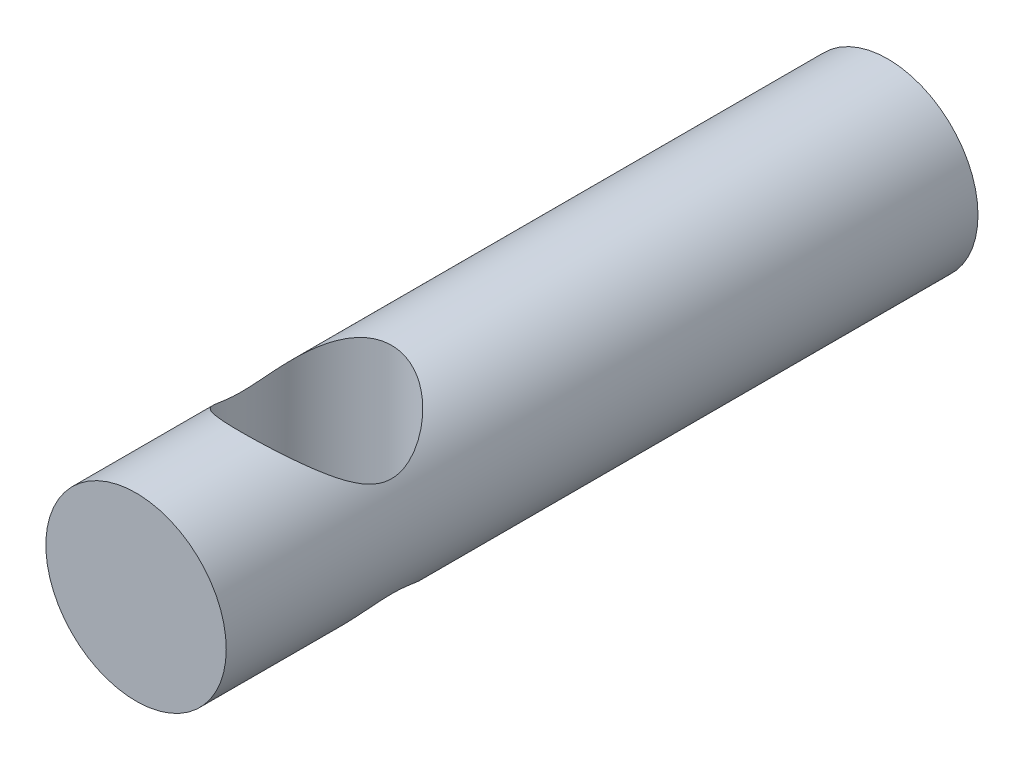
ISO-10303-21;
HEADER;
FILE_DESCRIPTION(('STEP AP214'),'2;1');
FILE_NAME('part.step','',(''),(''),'','','');
FILE_SCHEMA(('AUTOMOTIVE_DESIGN { 1 0 10303 214 1 1 1 1 }'));
ENDSEC;
DATA;
#1=APPLICATION_CONTEXT('core data for automotive mechanical design processes');
#2=APPLICATION_PROTOCOL_DEFINITION('international standard','automotive_design',2000,#1);
#3=PRODUCT_CONTEXT('',#1,'mechanical');
#4=PRODUCT('Part','Part','',(#3));
#5=PRODUCT_RELATED_PRODUCT_CATEGORY('part','',(#4));
#6=PRODUCT_DEFINITION_FORMATION('','',#4);
#7=PRODUCT_DEFINITION_CONTEXT('part definition',#1,'design');
#8=PRODUCT_DEFINITION('design','',#6,#7);
#9=PRODUCT_DEFINITION_SHAPE('','',#8);
#10=(LENGTH_UNIT() NAMED_UNIT(*) SI_UNIT(.MILLI.,.METRE.));
#11=(NAMED_UNIT(*) PLANE_ANGLE_UNIT() SI_UNIT($,.RADIAN.));
#12=(NAMED_UNIT(*) SI_UNIT($,.STERADIAN.) SOLID_ANGLE_UNIT());
#13=UNCERTAINTY_MEASURE_WITH_UNIT(LENGTH_MEASURE(1.E-05),#10,'distance_accuracy_value','');
#14=(GEOMETRIC_REPRESENTATION_CONTEXT(3) GLOBAL_UNCERTAINTY_ASSIGNED_CONTEXT((#13)) GLOBAL_UNIT_ASSIGNED_CONTEXT((#10,
#11,#12)) REPRESENTATION_CONTEXT('',''));
#15=CARTESIAN_POINT('',(0.,0.,0.));
#16=DIRECTION('',(0.,0.,1.));
#17=DIRECTION('',(1.,0.,0.));
#18=AXIS2_PLACEMENT_3D('',#15,#16,#17);
#19=CARTESIAN_POINT('',(0.,0.,50.));
#20=DIRECTION('',(0.,0.,-1.));
#21=DIRECTION('',(-1.,0.,0.));
#22=AXIS2_PLACEMENT_3D('',#19,#20,#21);
#23=CYLINDRICAL_SURFACE('',#22,6.);
#24=CARTESIAN_POINT('',(0.,-6.,43.));
#25=CARTESIAN_POINT('',(0.118803401095405,-6.00000636279643,43.0000064862677));
#26=CARTESIAN_POINT('',(0.237558182871218,-5.9964675633917,42.9957624327627));
#27=CARTESIAN_POINT('',(0.474087838067091,-5.98241218121961,42.978883422429));
#28=CARTESIAN_POINT('',(0.591862597565708,-5.97189479839916,42.9662475035226));
#29=CARTESIAN_POINT('',(0.825474733693953,-5.94410935213455,42.9328006783858));
#30=CARTESIAN_POINT('',(0.941311384241483,-5.92683881527392,42.9119867768663));
#31=CARTESIAN_POINT('',(1.17018155731566,-5.88593383048318,42.8625514514852));
#32=CARTESIAN_POINT('',(1.28321381003106,-5.86229655516696,42.8339265587894));
#33=CARTESIAN_POINT('',(1.61550772291657,-5.78287450226039,42.7374036224078));
#34=CARTESIAN_POINT('',(1.82964493287683,-5.71836951829061,42.6586078935356));
#35=CARTESIAN_POINT('',(2.23973970904935,-5.57056793109677,42.4759478557694));
#36=CARTESIAN_POINT('',(2.43569110189251,-5.48726497939233,42.3720750769835));
#37=CARTESIAN_POINT('',(2.74874935510359,-5.33520303254702,42.1793176524655));
#38=CARTESIAN_POINT('',(2.87121824175386,-5.27015451867263,42.0960532176638));
#39=CARTESIAN_POINT('',(3.10654667374618,-5.13495608214751,41.9205749148789));
#40=CARTESIAN_POINT('',(3.21940634431806,-5.06480622600091,41.8283611635591));
#41=CARTESIAN_POINT('',(3.43568816068562,-4.92066908923446,41.6355330827868));
#42=CARTESIAN_POINT('',(3.53908406033977,-4.84667197890407,41.5348967895774));
#43=CARTESIAN_POINT('',(3.73607907111508,-4.69649318853079,41.3260070437939));
#44=CARTESIAN_POINT('',(3.82967941338621,-4.62031178455679,41.2177545513249));
#45=CARTESIAN_POINT('',(4.00872533168448,-4.46590940619064,40.9918684752431));
#46=CARTESIAN_POINT('',(4.09398918746846,-4.38767669457347,40.874098937329));
#47=CARTESIAN_POINT('',(4.25431125048952,-4.23240914046917,40.630978700986));
#48=CARTESIAN_POINT('',(4.32936604026974,-4.15537470670733,40.5056254841293));
#49=CARTESIAN_POINT('',(4.46882104937819,-4.00501156130571,40.2474686695054));
#50=CARTESIAN_POINT('',(4.53324636625594,-3.93167441297209,40.1146836425388));
#51=CARTESIAN_POINT('',(4.65107409789266,-3.79155403229088,39.8411042236429));
#52=CARTESIAN_POINT('',(4.70448590476211,-3.72476524134073,39.7003167878289));
#53=CARTESIAN_POINT('',(4.8038705578035,-3.59583630496641,39.3966762287444));
#54=CARTESIAN_POINT('',(4.8486776643058,-3.53471789619366,39.2329915636929));
#55=CARTESIAN_POINT('',(4.92202476595886,-3.43187191424553,38.8961808118177));
#56=CARTESIAN_POINT('',(4.95060424437364,-3.39009732197608,38.7230787737634));
#57=CARTESIAN_POINT('',(4.97982440219376,-3.34688431376343,38.4576618963693));
#58=CARTESIAN_POINT('',(4.98729261982802,-3.33571370000032,38.3676186790102));
#59=CARTESIAN_POINT('',(4.99733565959028,-3.3206515347262,38.186635888056));
#60=CARTESIAN_POINT('',(4.99991093928053,-3.31675930257913,38.0956963990751));
#61=CARTESIAN_POINT('',(5.00008454722765,-3.31649708247112,37.9138046447105));
#62=CARTESIAN_POINT('',(4.99768286475912,-3.32012711072077,37.8228523792997));
#63=CARTESIAN_POINT('',(4.98797701095387,-3.33469045716225,37.6418002126219));
#64=CARTESIAN_POINT('',(4.9806722424497,-3.34562466496004,37.5517004165364));
#65=CARTESIAN_POINT('',(4.9605577711742,-3.37538324774709,37.3657096540125));
#66=CARTESIAN_POINT('',(4.94734291419499,-3.3947851529219,37.2699556702802));
#67=CARTESIAN_POINT('',(4.9157405398429,-3.44038747060614,37.0809279610888));
#68=CARTESIAN_POINT('',(4.89734936269663,-3.46659269219059,36.9876560417588));
#69=CARTESIAN_POINT('',(4.83487145070514,-3.55374344299518,36.7117320482717));
#70=CARTESIAN_POINT('',(4.78352415648848,-3.62315426397916,36.5333547362934));
#71=CARTESIAN_POINT('',(4.67632227850057,-3.76004871810486,36.2243192312532));
#72=CARTESIAN_POINT('',(4.62355194613134,-3.82500795712382,36.0913773000058));
#73=CARTESIAN_POINT('',(4.50808681272013,-3.96043831206372,35.8326966005586));
#74=CARTESIAN_POINT('',(4.44538619181528,-4.03091264789804,35.7069621156634));
#75=CARTESIAN_POINT('',(4.31043075762212,-4.17491879023624,35.4623371484108));
#76=CARTESIAN_POINT('',(4.23816312441515,-4.24845460689311,35.3434561621898));
#77=CARTESIAN_POINT('',(4.0843540141714,-4.39652708661221,35.112564357148));
#78=CARTESIAN_POINT('',(4.00281439970954,-4.47106354601933,35.0005521654441));
#79=CARTESIAN_POINT('',(3.82600354374307,-4.62342077684068,34.7777389037107));
#80=CARTESIAN_POINT('',(3.73023700414125,-4.70120929265264,34.6673079801861));
#81=CARTESIAN_POINT('',(3.52848927170201,-4.85446404087317,34.4544006001851));
#82=CARTESIAN_POINT('',(3.42250656330085,-4.92992992652313,34.3519253280094));
#83=CARTESIAN_POINT('',(3.20056123189974,-5.07681645366273,34.1557470520335));
#84=CARTESIAN_POINT('',(3.08461970676718,-5.14824514018381,34.0620263404979));
#85=CARTESIAN_POINT('',(2.84274064052497,-5.28566109460445,33.8840057357877));
#86=CARTESIAN_POINT('',(2.71680273442448,-5.35164816363854,33.7997061868722));
#87=CARTESIAN_POINT('',(2.38827463214804,-5.50853314592501,33.6012144581578));
#88=CARTESIAN_POINT('',(2.17932731194454,-5.59498946786027,33.4936807046978));
#89=CARTESIAN_POINT('',(1.85137170360811,-5.70840387054069,33.3538617808569));
#90=CARTESIAN_POINT('',(1.73959798407547,-5.74350440601256,33.3108268778131));
#91=CARTESIAN_POINT('',(1.51170856686386,-5.80764297166477,33.2324820657828));
#92=CARTESIAN_POINT('',(1.39559507719869,-5.83668403661188,33.1971682893954));
#93=CARTESIAN_POINT('',(1.15874024023433,-5.88830518104936,33.1345654668072));
#94=CARTESIAN_POINT('',(1.03796855116845,-5.91082981449132,33.107345234438));
#95=CARTESIAN_POINT('',(0.793680719841957,-5.94855722519953,33.0618327777203));
#96=CARTESIAN_POINT('',(0.670165967971726,-5.96376362711192,33.0435361335484));
#97=CARTESIAN_POINT('',(0.421443909131288,-5.98648272603519,33.0162230296845));
#98=CARTESIAN_POINT('',(0.296237084023924,-5.99399756851713,33.0072039821113));
#99=CARTESIAN_POINT('',(0.045281360658765,-6.00114166173048,32.9986294616952));
#100=CARTESIAN_POINT('',(-0.0804674771283793,-6.00077177047715,32.9990729591399));
#101=CARTESIAN_POINT('',(-0.316217699577978,-5.99267919208227,33.0087868090915));
#102=CARTESIAN_POINT('',(-0.426296149457811,-5.98584511760915,33.0169904113187));
#103=CARTESIAN_POINT('',(-0.645178571447246,-5.96622340308935,33.0405781997558));
#104=CARTESIAN_POINT('',(-0.753982136950641,-5.95343391393135,33.055964616179));
#105=CARTESIAN_POINT('',(-0.969508932578334,-5.922153588973,33.0936760737209));
#106=CARTESIAN_POINT('',(-1.07623280976895,-5.90366455762228,33.1159989188149));
#107=CARTESIAN_POINT('',(-1.28701083316511,-5.86132925877315,33.1672588546036));
#108=CARTESIAN_POINT('',(-1.39106394571242,-5.83748095091222,33.1961984644799));
#109=CARTESIAN_POINT('',(-1.70100357204863,-5.7578099796654,33.293220918707));
#110=CARTESIAN_POINT('',(-1.90197317990272,-5.69426548906173,33.3710253648875));
#111=CARTESIAN_POINT('',(-2.28736622034061,-5.55070829820293,33.5488074846758));
#112=CARTESIAN_POINT('',(-2.4717835011244,-5.47068951124314,33.6487933546439));
#113=CARTESIAN_POINT('',(-2.77431022087586,-5.32196402989805,33.8375869663724));
#114=CARTESIAN_POINT('',(-2.89671891082122,-5.25618753965957,33.9219211863686));
#115=CARTESIAN_POINT('',(-3.131821244568,-5.11958730343164,34.099563688916));
#116=CARTESIAN_POINT('',(-3.24451452031804,-5.04876336641404,34.1928723111637));
#117=CARTESIAN_POINT('',(-3.46039828484841,-4.9033290991082,34.3879535768143));
#118=CARTESIAN_POINT('',(-3.56355916557859,-4.82870801884465,34.4897508388439));
#119=CARTESIAN_POINT('',(-3.75997885952874,-4.67738428016309,34.7010061199085));
#120=CARTESIAN_POINT('',(-3.85323906840846,-4.60068191705468,34.8104630555697));
#121=CARTESIAN_POINT('',(-4.03144708201687,-4.44540721169773,35.0387864958512));
#122=CARTESIAN_POINT('',(-4.11621624228698,-4.36682597084091,35.1577863469535));
#123=CARTESIAN_POINT('',(-4.27543853436326,-4.21106013919064,35.4034518346895));
#124=CARTESIAN_POINT('',(-4.34988795406828,-4.13387605960318,35.5301202063392));
#125=CARTESIAN_POINT('',(-4.48797579821676,-3.98352281099524,35.7909734658198));
#126=CARTESIAN_POINT('',(-4.55164272839412,-3.9103434132128,35.9251372468657));
#127=CARTESIAN_POINT('',(-4.66777738062598,-3.77095158572992,36.2015834075756));
#128=CARTESIAN_POINT('',(-4.72025536508448,-3.70473280033071,36.3438581947439));
#129=CARTESIAN_POINT('',(-4.81674752553354,-3.57850891369614,36.6485305374172));
#130=CARTESIAN_POINT('',(-4.85976816309609,-3.51940536010279,36.8116302195377));
#131=CARTESIAN_POINT('',(-4.92964324178357,-3.42087013106355,37.1469424932384));
#132=CARTESIAN_POINT('',(-4.95653805629938,-3.38138936984465,37.31913114198));
#133=CARTESIAN_POINT('',(-4.98335884043903,-3.34161185607347,37.5827328811766));
#134=CARTESIAN_POINT('',(-4.9900439743412,-3.33159299706688,37.6720601142706));
#135=CARTESIAN_POINT('',(-4.99859875462369,-3.31874657694375,37.851477467416));
#136=CARTESIAN_POINT('',(-5.00046880529626,-3.31591841207014,37.9415675227807));
#137=CARTESIAN_POINT('',(-4.99933140644564,-3.31763235091844,38.1216442281894));
#138=CARTESIAN_POINT('',(-4.99632384110741,-3.32217462964556,38.2116308757273));
#139=CARTESIAN_POINT('',(-4.98551920595954,-3.33836659549378,38.3907057316909));
#140=CARTESIAN_POINT('',(-4.97771962684742,-3.3500200062847,38.4797934445376));
#141=CARTESIAN_POINT('',(-4.95646386284238,-3.38139896959306,38.6656700002972));
#142=CARTESIAN_POINT('',(-4.94249693749092,-3.40184751901395,38.7622775823279));
#143=CARTESIAN_POINT('',(-4.90931375512976,-3.44956299936088,38.9528976553845));
#144=CARTESIAN_POINT('',(-4.89009367595845,-3.47683489368277,39.0469082017716));
#145=CARTESIAN_POINT('',(-4.82502893529809,-3.56715037769761,39.324905192478));
#146=CARTESIAN_POINT('',(-4.7718260132866,-3.63862034946249,39.5044742591731));
#147=CARTESIAN_POINT('',(-4.66101333620415,-3.77905708413606,39.8156053015322));
#148=CARTESIAN_POINT('',(-4.60651894445035,-3.84555788327451,39.9494855746156));
#149=CARTESIAN_POINT('',(-4.48741065580202,-3.98390215298826,40.2098947178368));
#150=CARTESIAN_POINT('',(-4.42279087534717,-4.05574871700041,40.3364192548024));
#151=CARTESIAN_POINT('',(-4.28378589016391,-4.20230923095865,40.5824750393764));
#152=CARTESIAN_POINT('',(-4.20938767793868,-4.27702690475066,40.7019966598466));
#153=CARTESIAN_POINT('',(-4.05109347216151,-4.42725084654703,40.9339993633005));
#154=CARTESIAN_POINT('',(-3.96719939385689,-4.50275695275139,41.0464818589428));
#155=CARTESIAN_POINT('',(-3.78559728592263,-4.65661946215906,41.2697029917224));
#156=CARTESIAN_POINT('',(-3.68741297206343,-4.73493356113396,41.3800842070447));
#157=CARTESIAN_POINT('',(-3.48062708656676,-4.88895347699909,41.5926628641469));
#158=CARTESIAN_POINT('',(-3.37202387840544,-4.96465888158803,41.694859015636));
#159=CARTESIAN_POINT('',(-3.14465963115802,-5.11169145947054,41.8901812782145));
#160=CARTESIAN_POINT('',(-3.02592088507471,-5.18302767756748,41.9833263782086));
#161=CARTESIAN_POINT('',(-2.77827797167406,-5.31988980472136,42.1598471824308));
#162=CARTESIAN_POINT('',(-2.64937275881189,-5.38541511469399,42.2432218796487));
#163=CARTESIAN_POINT('',(-2.31715775505754,-5.538800757023,42.4365839258149));
#164=CARTESIAN_POINT('',(-2.10785901335215,-5.62226392609453,42.5401082380941));
#165=CARTESIAN_POINT('',(-1.78004652854701,-5.73103285742107,42.6739058337314));
#166=CARTESIAN_POINT('',(-1.66848545194815,-5.76454715656679,42.7149183204556));
#167=CARTESIAN_POINT('',(-1.44122911865488,-5.82552080229895,42.7892741907767));
#168=CARTESIAN_POINT('',(-1.32553443865744,-5.8529809897173,42.8226186393853));
#169=CARTESIAN_POINT('',(-1.01333234603961,-5.91714489125081,42.9003434639148));
#170=CARTESIAN_POINT('',(-0.813745597053237,-5.94804013902009,42.937546782437));
#171=CARTESIAN_POINT('',(-0.409390797411395,-5.98946116455115,42.987368198136));
#172=CARTESIAN_POINT('',(-0.204623282772278,-5.99998904091734,42.9999888282543));
#173=CARTESIAN_POINT('',(0.,-6.,43.));
#174=B_SPLINE_CURVE_WITH_KNOTS('',3,(#24,#25,#26,#27,#28,#29,#30,#31,#32,#33,#34,#35,#36,#37,
#38,#39,#40,#41,#42,#43,#44,#45,#46,#47,#48,#49,#50,#51,#52,#53,#54,#55,#56,#57,#58,#59,#60,#61,
#62,#63,#64,#65,#66,#67,#68,#69,#70,#71,#72,#73,#74,#75,#76,#77,#78,#79,#80,#81,#82,#83,#84,#85,
#86,#87,#88,#89,#90,#91,#92,#93,#94,#95,#96,#97,#98,#99,#100,#101,#102,#103,#104,#105,#106,#107,
#108,#109,#110,#111,#112,#113,#114,#115,#116,#117,#118,#119,#120,#121,#122,#123,#124,#125,#126,
#127,#128,#129,#130,#131,#132,#133,#134,#135,#136,#137,#138,#139,#140,#141,#142,#143,#144,#145,
#146,#147,#148,#149,#150,#151,#152,#153,#154,#155,#156,#157,#158,#159,#160,#161,#162,#163,#164,
#165,#166,#167,#168,#169,#170,#171,#172,#173),.UNSPECIFIED.,.T.,.F.,(4,2,2,2,2,2,2,2,2,2,2,2,2,
2,2,2,2,2,2,2,2,2,2,2,2,2,2,2,2,2,2,2,2,2,2,2,2,2,2,2,2,2,2,2,2,2,2,2,2,2,2,2,2,2,2,2,2,2,2,2,2,
2,2,2,2,2,2,2,2,2,2,2,2,2,4),(0.,0.356198531128419,0.712437905356866,1.06880787854775,
1.42533637270188,2.13333209783897,2.84156728725027,3.32622201622343,3.81087042808177,
4.2968245963956,4.78271761425373,5.2775503603996,5.77254834493271,6.26636031071475,
6.75974940543413,7.29936255278481,7.83765708456692,8.11040822806104,8.38313386402393,
8.65586008771504,8.92861953390792,9.22392701856221,9.51944381892724,10.1116379066242,
10.5823769120489,11.0533928323055,11.5250464324407,11.9966054526408,12.4928422896337,
12.9891528567514,13.4844367603639,13.9797387562551,14.7274446962693,15.10150349884,
15.4753745093337,15.8523389140401,16.2291164194432,16.6057887984766,16.9824201883012,
17.3138076935884,17.6452981608744,17.9766837873554,18.3081957920453,18.9794342536,
19.6509211619365,20.1379627282136,20.6250227371037,21.1135480143902,21.6020043344423,
22.0992028034934,22.5965796576366,23.0926203414622,23.5882040850607,24.1228614856737,
24.6561746412001,24.9262177314021,25.196238147046,25.4662649741992,25.7364333195518,
26.0351569724179,26.3340985560114,26.9331443359532,27.4099325615983,27.8869988690867,
28.3647063284082,28.8423176087131,29.3434029116174,29.8445670506109,30.3446559675372,
30.8447963820891,31.5852621624668,31.9553671316833,32.325420666041,32.9389891607904,
33.5524944315665),.UNSPECIFIED.);
#175=CARTESIAN_POINT('',(0.,-6.,43.));
#176=VERTEX_POINT('',#175);
#177=EDGE_CURVE('E10',#176,#176,#174,.T.);
#178=ORIENTED_EDGE('',*,*,#177,.T.);
#179=EDGE_LOOP('',(#178));
#180=FACE_BOUND('',#179,.T.);
#181=CARTESIAN_POINT('',(0.,6.,43.));
#182=CARTESIAN_POINT('',(-0.118803401095405,6.00000636279643,43.0000064862677));
#183=CARTESIAN_POINT('',(-0.237558182871218,5.9964675633917,42.9957624327627));
#184=CARTESIAN_POINT('',(-0.474087838067092,5.98241218121961,42.978883422429));
#185=CARTESIAN_POINT('',(-0.591862597565709,5.97189479839916,42.9662475035226));
#186=CARTESIAN_POINT('',(-0.825474733693953,5.94410935213455,42.9328006783858));
#187=CARTESIAN_POINT('',(-0.941311384241483,5.92683881527392,42.9119867768663));
#188=CARTESIAN_POINT('',(-1.17018155731566,5.88593383048317,42.8625514514852));
#189=CARTESIAN_POINT('',(-1.28321381003106,5.86229655516696,42.8339265587894));
#190=CARTESIAN_POINT('',(-1.61550772291657,5.78287450226039,42.7374036224078));
#191=CARTESIAN_POINT('',(-1.82964493287683,5.71836951829061,42.6586078935356));
#192=CARTESIAN_POINT('',(-2.23973970904936,5.57056793109677,42.4759478557694));
#193=CARTESIAN_POINT('',(-2.43569110189251,5.48726497939233,42.3720750769835));
#194=CARTESIAN_POINT('',(-2.74874935510359,5.33520303254702,42.1793176524655));
#195=CARTESIAN_POINT('',(-2.87121824175386,5.27015451867263,42.0960532176638));
#196=CARTESIAN_POINT('',(-3.10654667374618,5.13495608214751,41.9205749148789));
#197=CARTESIAN_POINT('',(-3.21940634431806,5.06480622600091,41.8283611635591));
#198=CARTESIAN_POINT('',(-3.43568816068562,4.92066908923446,41.6355330827867));
#199=CARTESIAN_POINT('',(-3.53908406033977,4.84667197890407,41.5348967895774));
#200=CARTESIAN_POINT('',(-3.73607907111508,4.69649318853078,41.3260070437939));
#201=CARTESIAN_POINT('',(-3.82967941338621,4.62031178455678,41.2177545513249));
#202=CARTESIAN_POINT('',(-4.00872533168449,4.46590940619063,40.9918684752431));
#203=CARTESIAN_POINT('',(-4.09398918746846,4.38767669457347,40.874098937329));
#204=CARTESIAN_POINT('',(-4.25431125048953,4.23240914046916,40.6309787009859));
#205=CARTESIAN_POINT('',(-4.32936604026975,4.15537470670733,40.5056254841293));
#206=CARTESIAN_POINT('',(-4.4688210493782,4.0050115613057,40.2474686695054));
#207=CARTESIAN_POINT('',(-4.53324636625595,3.93167441297208,40.1146836425388));
#208=CARTESIAN_POINT('',(-4.65107409789267,3.79155403229088,39.8411042236429));
#209=CARTESIAN_POINT('',(-4.70448590476211,3.72476524134072,39.7003167878289));
#210=CARTESIAN_POINT('',(-4.8038705578035,3.59583630496641,39.3966762287444));
#211=CARTESIAN_POINT('',(-4.8486776643058,3.53471789619366,39.2329915636929));
#212=CARTESIAN_POINT('',(-4.92202476595886,3.43187191424553,38.8961808118177));
#213=CARTESIAN_POINT('',(-4.95060424437364,3.39009732197608,38.7230787737634));
#214=CARTESIAN_POINT('',(-4.97982440219376,3.34688431376343,38.4576618963693));
#215=CARTESIAN_POINT('',(-4.98729261982801,3.33571370000033,38.3676186790102));
#216=CARTESIAN_POINT('',(-4.99733565959028,3.3206515347262,38.186635888056));
#217=CARTESIAN_POINT('',(-4.99991093928052,3.31675930257913,38.0956963990751));
#218=CARTESIAN_POINT('',(-5.00008454722765,3.31649708247112,37.9138046447105));
#219=CARTESIAN_POINT('',(-4.99768286475912,3.32012711072076,37.8228523792997));
#220=CARTESIAN_POINT('',(-4.98797701095387,3.33469045716225,37.6418002126219));
#221=CARTESIAN_POINT('',(-4.9806722424497,3.34562466496004,37.5517004165364));
#222=CARTESIAN_POINT('',(-4.9605577711742,3.37538324774709,37.3657096540125));
#223=CARTESIAN_POINT('',(-4.94734291419499,3.3947851529219,37.2699556702802));
#224=CARTESIAN_POINT('',(-4.9157405398429,3.44038747060614,37.0809279610888));
#225=CARTESIAN_POINT('',(-4.89734936269664,3.46659269219059,36.9876560417588));
#226=CARTESIAN_POINT('',(-4.83487145070514,3.55374344299518,36.7117320482717));
#227=CARTESIAN_POINT('',(-4.78352415648848,3.62315426397916,36.5333547362934));
#228=CARTESIAN_POINT('',(-4.67632227850057,3.76004871810486,36.2243192312532));
#229=CARTESIAN_POINT('',(-4.62355194613134,3.82500795712382,36.0913773000058));
#230=CARTESIAN_POINT('',(-4.50808681272013,3.96043831206372,35.8326966005586));
#231=CARTESIAN_POINT('',(-4.44538619181528,4.03091264789804,35.7069621156634));
#232=CARTESIAN_POINT('',(-4.31043075762212,4.17491879023624,35.4623371484108));
#233=CARTESIAN_POINT('',(-4.23816312441515,4.24845460689311,35.3434561621898));
#234=CARTESIAN_POINT('',(-4.08435401417139,4.39652708661221,35.112564357148));
#235=CARTESIAN_POINT('',(-4.00281439970954,4.47106354601933,35.0005521654441));
#236=CARTESIAN_POINT('',(-3.82600354374307,4.62342077684068,34.7777389037107));
#237=CARTESIAN_POINT('',(-3.73023700414125,4.70120929265264,34.6673079801861));
#238=CARTESIAN_POINT('',(-3.52848927170202,4.85446404087317,34.4544006001851));
#239=CARTESIAN_POINT('',(-3.42250656330085,4.92992992652313,34.3519253280094));
#240=CARTESIAN_POINT('',(-3.20056123189974,5.07681645366273,34.1557470520335));
#241=CARTESIAN_POINT('',(-3.08461970676718,5.14824514018381,34.0620263404979));
#242=CARTESIAN_POINT('',(-2.84274064052497,5.28566109460445,33.8840057357877));
#243=CARTESIAN_POINT('',(-2.71680273442449,5.35164816363853,33.7997061868722));
#244=CARTESIAN_POINT('',(-2.38827463214804,5.50853314592501,33.6012144581578));
#245=CARTESIAN_POINT('',(-2.17932731194454,5.59498946786026,33.4936807046978));
#246=CARTESIAN_POINT('',(-1.85137170360811,5.70840387054069,33.3538617808569));
#247=CARTESIAN_POINT('',(-1.73959798407548,5.74350440601255,33.3108268778131));
#248=CARTESIAN_POINT('',(-1.51170856686386,5.80764297166477,33.2324820657828));
#249=CARTESIAN_POINT('',(-1.3955950771987,5.83668403661188,33.1971682893954));
#250=CARTESIAN_POINT('',(-1.15874024023433,5.88830518104936,33.1345654668072));
#251=CARTESIAN_POINT('',(-1.03796855116845,5.91082981449132,33.107345234438));
#252=CARTESIAN_POINT('',(-0.793680719841959,5.94855722519953,33.0618327777203));
#253=CARTESIAN_POINT('',(-0.670165967971729,5.96376362711192,33.0435361335484));
#254=CARTESIAN_POINT('',(-0.421443909131291,5.98648272603519,33.0162230296845));
#255=CARTESIAN_POINT('',(-0.296237084023929,5.99399756851713,33.0072039821113));
#256=CARTESIAN_POINT('',(-0.0452813606587702,6.00114166173048,32.9986294616952));
#257=CARTESIAN_POINT('',(0.0804674771283748,6.00077177047715,32.9990729591399));
#258=CARTESIAN_POINT('',(0.316217699577974,5.99267919208227,33.0087868090915));
#259=CARTESIAN_POINT('',(0.426296149457807,5.98584511760915,33.0169904113187));
#260=CARTESIAN_POINT('',(0.645178571447243,5.96622340308935,33.0405781997558));
#261=CARTESIAN_POINT('',(0.753982136950637,5.95343391393135,33.055964616179));
#262=CARTESIAN_POINT('',(0.969508932578331,5.92215358897301,33.0936760737209));
#263=CARTESIAN_POINT('',(1.07623280976895,5.90366455762228,33.1159989188149));
#264=CARTESIAN_POINT('',(1.28701083316511,5.86132925877315,33.1672588546036));
#265=CARTESIAN_POINT('',(1.39106394571242,5.83748095091223,33.1961984644799));
#266=CARTESIAN_POINT('',(1.70100357204863,5.7578099796654,33.293220918707));
#267=CARTESIAN_POINT('',(1.90197317990272,5.69426548906173,33.3710253648875));
#268=CARTESIAN_POINT('',(2.28736622034061,5.55070829820293,33.5488074846758));
#269=CARTESIAN_POINT('',(2.4717835011244,5.47068951124314,33.6487933546439));
#270=CARTESIAN_POINT('',(2.77431022087586,5.32196402989805,33.8375869663724));
#271=CARTESIAN_POINT('',(2.89671891082122,5.25618753965957,33.9219211863686));
#272=CARTESIAN_POINT('',(3.131821244568,5.11958730343164,34.099563688916));
#273=CARTESIAN_POINT('',(3.24451452031804,5.04876336641404,34.1928723111637));
#274=CARTESIAN_POINT('',(3.46039828484841,4.9033290991082,34.3879535768143));
#275=CARTESIAN_POINT('',(3.56355916557859,4.82870801884465,34.4897508388439));
#276=CARTESIAN_POINT('',(3.75997885952874,4.67738428016309,34.7010061199085));
#277=CARTESIAN_POINT('',(3.85323906840846,4.60068191705468,34.8104630555697));
#278=CARTESIAN_POINT('',(4.03144708201687,4.44540721169773,35.0387864958512));
#279=CARTESIAN_POINT('',(4.11621624228698,4.36682597084091,35.1577863469535));
#280=CARTESIAN_POINT('',(4.27543853436326,4.21106013919064,35.4034518346895));
#281=CARTESIAN_POINT('',(4.34988795406828,4.13387605960318,35.5301202063392));
#282=CARTESIAN_POINT('',(4.48797579821676,3.98352281099524,35.7909734658198));
#283=CARTESIAN_POINT('',(4.55164272839412,3.9103434132128,35.9251372468657));
#284=CARTESIAN_POINT('',(4.66777738062598,3.77095158572992,36.2015834075756));
#285=CARTESIAN_POINT('',(4.72025536508448,3.70473280033071,36.3438581947439));
#286=CARTESIAN_POINT('',(4.81674752553354,3.57850891369614,36.6485305374172));
#287=CARTESIAN_POINT('',(4.85976816309609,3.51940536010279,36.8116302195377));
#288=CARTESIAN_POINT('',(4.92964324178357,3.42087013106355,37.1469424932384));
#289=CARTESIAN_POINT('',(4.95653805629938,3.38138936984465,37.31913114198));
#290=CARTESIAN_POINT('',(4.98335884043903,3.34161185607347,37.5827328811766));
#291=CARTESIAN_POINT('',(4.9900439743412,3.33159299706688,37.6720601142706));
#292=CARTESIAN_POINT('',(4.99859875462369,3.31874657694375,37.851477467416));
#293=CARTESIAN_POINT('',(5.00046880529626,3.31591841207014,37.9415675227807));
#294=CARTESIAN_POINT('',(4.99933140644564,3.31763235091844,38.1216442281894));
#295=CARTESIAN_POINT('',(4.99632384110741,3.32217462964556,38.2116308757273));
#296=CARTESIAN_POINT('',(4.98551920595954,3.33836659549378,38.3907057316909));
#297=CARTESIAN_POINT('',(4.97771962684742,3.3500200062847,38.4797934445376));
#298=CARTESIAN_POINT('',(4.95646386284238,3.38139896959306,38.6656700002972));
#299=CARTESIAN_POINT('',(4.94249693749092,3.40184751901395,38.7622775823279));
#300=CARTESIAN_POINT('',(4.90931375512976,3.44956299936088,38.9528976553845));
#301=CARTESIAN_POINT('',(4.89009367595845,3.47683489368277,39.0469082017716));
#302=CARTESIAN_POINT('',(4.82502893529809,3.56715037769761,39.324905192478));
#303=CARTESIAN_POINT('',(4.7718260132866,3.63862034946249,39.5044742591731));
#304=CARTESIAN_POINT('',(4.66101333620415,3.77905708413606,39.8156053015322));
#305=CARTESIAN_POINT('',(4.60651894445035,3.84555788327451,39.9494855746156));
#306=CARTESIAN_POINT('',(4.48741065580202,3.98390215298826,40.2098947178368));
#307=CARTESIAN_POINT('',(4.42279087534717,4.05574871700041,40.3364192548024));
#308=CARTESIAN_POINT('',(4.28378589016391,4.20230923095865,40.5824750393764));
#309=CARTESIAN_POINT('',(4.20938767793868,4.27702690475066,40.7019966598466));
#310=CARTESIAN_POINT('',(4.05109347216151,4.42725084654703,40.9339993633005));
#311=CARTESIAN_POINT('',(3.96719939385689,4.50275695275139,41.0464818589428));
#312=CARTESIAN_POINT('',(3.78559728592263,4.65661946215906,41.2697029917224));
#313=CARTESIAN_POINT('',(3.68741297206343,4.73493356113396,41.3800842070447));
#314=CARTESIAN_POINT('',(3.48062708656676,4.88895347699909,41.5926628641469));
#315=CARTESIAN_POINT('',(3.37202387840544,4.96465888158803,41.694859015636));
#316=CARTESIAN_POINT('',(3.14465963115802,5.11169145947053,41.8901812782145));
#317=CARTESIAN_POINT('',(3.02592088507471,5.18302767756748,41.9833263782086));
#318=CARTESIAN_POINT('',(2.77827797167406,5.31988980472136,42.1598471824308));
#319=CARTESIAN_POINT('',(2.6493727588119,5.38541511469399,42.2432218796487));
#320=CARTESIAN_POINT('',(2.31715775505754,5.53880075702299,42.4365839258149));
#321=CARTESIAN_POINT('',(2.10785901335215,5.62226392609452,42.5401082380941));
#322=CARTESIAN_POINT('',(1.78004652854702,5.73103285742106,42.6739058337313));
#323=CARTESIAN_POINT('',(1.66848545194816,5.76454715656679,42.7149183204556));
#324=CARTESIAN_POINT('',(1.44122911865488,5.82552080229895,42.7892741907767));
#325=CARTESIAN_POINT('',(1.32553443865745,5.8529809897173,42.8226186393853));
#326=CARTESIAN_POINT('',(1.01333234603962,5.91714489125081,42.9003434639148));
#327=CARTESIAN_POINT('',(0.813745597053243,5.94804013902009,42.937546782437));
#328=CARTESIAN_POINT('',(0.4093907974114,5.98946116455115,42.987368198136));
#329=CARTESIAN_POINT('',(0.20462328277228,5.99998904091733,42.9999888282543));
#330=CARTESIAN_POINT('',(0.,6.,43.));
#331=B_SPLINE_CURVE_WITH_KNOTS('',3,(#181,#182,#183,#184,#185,#186,#187,#188,#189,#190,#191,
#192,#193,#194,#195,#196,#197,#198,#199,#200,#201,#202,#203,#204,#205,#206,#207,#208,#209,#210,
#211,#212,#213,#214,#215,#216,#217,#218,#219,#220,#221,#222,#223,#224,#225,#226,#227,#228,#229,
#230,#231,#232,#233,#234,#235,#236,#237,#238,#239,#240,#241,#242,#243,#244,#245,#246,#247,#248,
#249,#250,#251,#252,#253,#254,#255,#256,#257,#258,#259,#260,#261,#262,#263,#264,#265,#266,#267,
#268,#269,#270,#271,#272,#273,#274,#275,#276,#277,#278,#279,#280,#281,#282,#283,#284,#285,#286,
#287,#288,#289,#290,#291,#292,#293,#294,#295,#296,#297,#298,#299,#300,#301,#302,#303,#304,#305,
#306,#307,#308,#309,#310,#311,#312,#313,#314,#315,#316,#317,#318,#319,#320,#321,#322,#323,#324,
#325,#326,#327,#328,#329,#330),.UNSPECIFIED.,.T.,.F.,(4,2,2,2,2,2,2,2,2,2,2,2,2,2,2,2,2,2,2,2,2,
2,2,2,2,2,2,2,2,2,2,2,2,2,2,2,2,2,2,2,2,2,2,2,2,2,2,2,2,2,2,2,2,2,2,2,2,2,2,2,2,2,2,2,2,2,2,2,2,
2,2,2,2,2,4),(0.,0.356198531128419,0.712437905356867,1.06880787854775,1.42533637270188,
2.13333209783898,2.84156728725027,3.32622201622343,3.81087042808178,4.2968245963956,
4.78271761425373,5.27755036039961,5.77254834493272,6.26636031071477,6.75974940543414,
7.29936255278482,7.83765708456692,8.11040822806101,8.38313386402392,8.65586008771503,
8.92861953390791,9.22392701856221,9.51944381892723,10.1116379066242,10.5823769120489,
11.0533928323055,11.5250464324407,11.9966054526408,12.4928422896337,12.9891528567514,
13.4844367603639,13.9797387562551,14.7274446962692,15.10150349884,15.4753745093336,
15.8523389140401,16.2291164194432,16.6057887984766,16.9824201883012,17.3138076935884,
17.6452981608744,17.9766837873554,18.3081957920453,18.9794342536,19.6509211619365,
20.1379627282136,20.6250227371037,21.1135480143902,21.6020043344423,22.0992028034934,
22.5965796576366,23.0926203414622,23.5882040850607,24.1228614856737,24.6561746412001,
24.9262177314021,25.196238147046,25.4662649741991,25.7364333195518,26.0351569724179,
26.3340985560114,26.9331443359532,27.4099325615983,27.8869988690867,28.3647063284082,
28.8423176087131,29.3434029116174,29.8445670506109,30.3446559675372,30.8447963820891,
31.5852621624668,31.9553671316833,32.325420666041,32.9389891607904,33.5524944315665),.UNSPECIFIED.);
#332=CARTESIAN_POINT('',(0.,6.,43.));
#333=VERTEX_POINT('',#332);
#334=EDGE_CURVE('E41',#333,#333,#331,.T.);
#335=ORIENTED_EDGE('',*,*,#334,.T.);
#336=EDGE_LOOP('',(#335));
#337=FACE_BOUND('',#336,.T.);
#338=CARTESIAN_POINT('',(0.,0.,50.));
#339=DIRECTION('',(0.,0.,1.));
#340=DIRECTION('',(1.,0.,0.));
#341=AXIS2_PLACEMENT_3D('',#338,#339,#340);
#342=CIRCLE('',#341,6.);
#343=CARTESIAN_POINT('',(6.,0.,50.));
#344=VERTEX_POINT('',#343);
#345=EDGE_CURVE('E45',#344,#344,#342,.T.);
#346=ORIENTED_EDGE('',*,*,#345,.F.);
#347=EDGE_LOOP('',(#346));
#348=FACE_BOUND('',#347,.T.);
#349=CARTESIAN_POINT('',(0.,0.,0.));
#350=DIRECTION('',(0.,0.,1.));
#351=DIRECTION('',(1.,0.,0.));
#352=AXIS2_PLACEMENT_3D('',#349,#350,#351);
#353=CIRCLE('',#352,6.);
#354=CARTESIAN_POINT('',(6.,0.,0.));
#355=VERTEX_POINT('',#354);
#356=EDGE_CURVE('E49',#355,#355,#353,.T.);
#357=ORIENTED_EDGE('',*,*,#356,.T.);
#358=EDGE_LOOP('',(#357));
#359=FACE_BOUND('',#358,.T.);
#360=ADVANCED_FACE('F31',(#180,#337,#348,#359),#23,.T.);
#361=CARTESIAN_POINT('',(0.,0.,50.));
#362=DIRECTION('',(0.,0.,1.));
#363=DIRECTION('',(1.,0.,0.));
#364=AXIS2_PLACEMENT_3D('',#361,#362,#363);
#365=PLANE('',#364);
#366=ORIENTED_EDGE('',*,*,#345,.T.);
#367=EDGE_LOOP('',(#366));
#368=FACE_BOUND('',#367,.T.);
#369=ADVANCED_FACE('F60',(#368),#365,.T.);
#370=CARTESIAN_POINT('',(0.,0.,0.));
#371=DIRECTION('',(0.,0.,1.));
#372=DIRECTION('',(1.,0.,0.));
#373=AXIS2_PLACEMENT_3D('',#370,#371,#372);
#374=PLANE('',#373);
#375=ORIENTED_EDGE('',*,*,#356,.F.);
#376=EDGE_LOOP('',(#375));
#377=FACE_BOUND('',#376,.T.);
#378=ADVANCED_FACE('F58',(#377),#374,.F.);
#379=CARTESIAN_POINT('',(0.,-6.,38.));
#380=DIRECTION('',(0.,1.,0.));
#381=DIRECTION('',(0.,0.,1.));
#382=AXIS2_PLACEMENT_3D('',#379,#380,#381);
#383=CYLINDRICAL_SURFACE('',#382,5.);
#384=ORIENTED_EDGE('',*,*,#334,.F.);
#385=EDGE_LOOP('',(#384));
#386=FACE_BOUND('',#385,.T.);
#387=ORIENTED_EDGE('',*,*,#177,.F.);
#388=EDGE_LOOP('',(#387));
#389=FACE_BOUND('',#388,.T.);
#390=ADVANCED_FACE('F54',(#386,#389),#383,.F.);
#391=CLOSED_SHELL('',(#360,#369,#378,#390));
#392=MANIFOLD_SOLID_BREP('B2',#391);
#393=ADVANCED_BREP_SHAPE_REPRESENTATION('',(#18,#392),#14);
#394=SHAPE_DEFINITION_REPRESENTATION(#9,#393);
ENDSEC;
END-ISO-10303-21;
